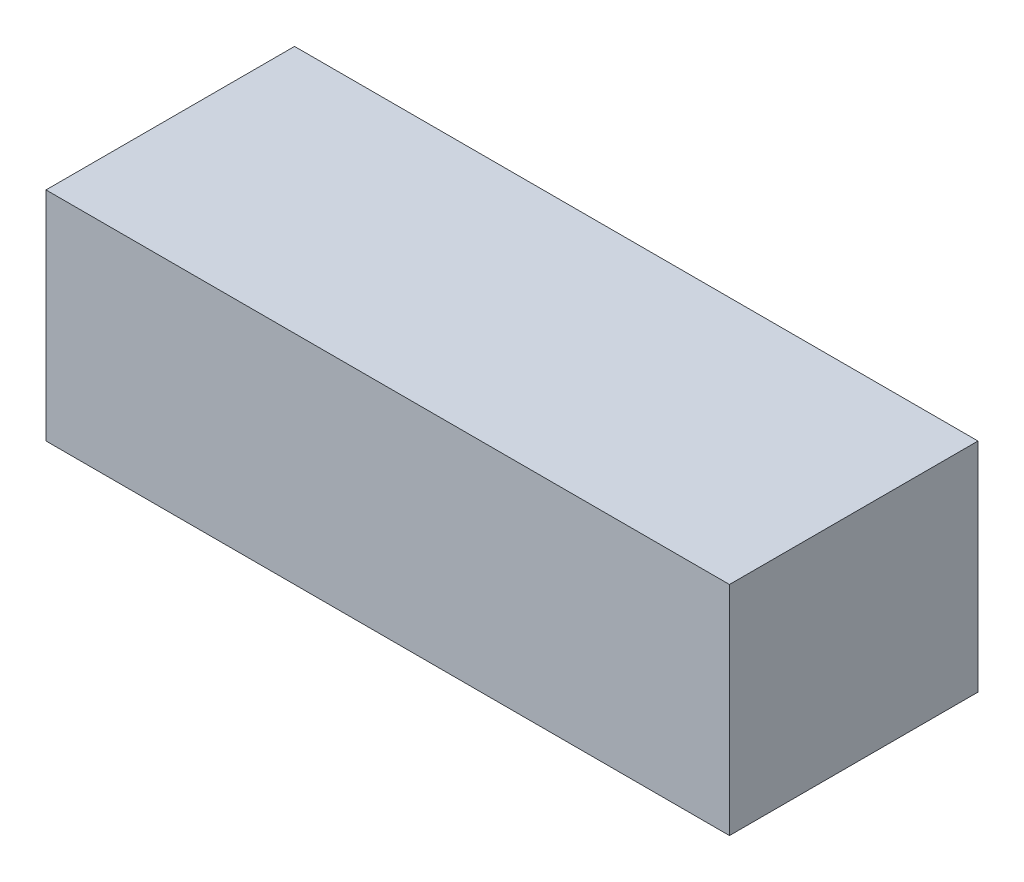
ISO-10303-21;
HEADER;
FILE_DESCRIPTION(('STEP AP214'),'2;1');
FILE_NAME('part.step','',(''),(''),'','','');
FILE_SCHEMA(('AUTOMOTIVE_DESIGN { 1 0 10303 214 1 1 1 1 }'));
ENDSEC;
DATA;
#1=APPLICATION_CONTEXT('core data for automotive mechanical design processes');
#2=APPLICATION_PROTOCOL_DEFINITION('international standard','automotive_design',2000,#1);
#3=PRODUCT_CONTEXT('',#1,'mechanical');
#4=PRODUCT('Part','Part','',(#3));
#5=PRODUCT_RELATED_PRODUCT_CATEGORY('part','',(#4));
#6=PRODUCT_DEFINITION_FORMATION('','',#4);
#7=PRODUCT_DEFINITION_CONTEXT('part definition',#1,'design');
#8=PRODUCT_DEFINITION('design','',#6,#7);
#9=PRODUCT_DEFINITION_SHAPE('','',#8);
#10=(LENGTH_UNIT() NAMED_UNIT(*) SI_UNIT(.MILLI.,.METRE.));
#11=(NAMED_UNIT(*) PLANE_ANGLE_UNIT() SI_UNIT($,.RADIAN.));
#12=(NAMED_UNIT(*) SI_UNIT($,.STERADIAN.) SOLID_ANGLE_UNIT());
#13=UNCERTAINTY_MEASURE_WITH_UNIT(LENGTH_MEASURE(1.E-05),#10,'distance_accuracy_value','');
#14=(GEOMETRIC_REPRESENTATION_CONTEXT(3) GLOBAL_UNCERTAINTY_ASSIGNED_CONTEXT((#13)) GLOBAL_UNIT_ASSIGNED_CONTEXT((#10,
#11,#12)) REPRESENTATION_CONTEXT('',''));
#15=CARTESIAN_POINT('',(0.,0.,0.));
#16=DIRECTION('',(0.,0.,1.));
#17=DIRECTION('',(1.,0.,0.));
#18=AXIS2_PLACEMENT_3D('',#15,#16,#17);
#19=CARTESIAN_POINT('',(22.,14.,8.));
#20=DIRECTION('',(-1.,0.,0.));
#21=DIRECTION('',(0.,0.,1.));
#22=AXIS2_PLACEMENT_3D('',#19,#20,#21);
#23=PLANE('',#22);
#24=DIRECTION('',(0.,0.,-1.));
#25=VECTOR('',#24,1.);
#26=CARTESIAN_POINT('',(22.,0.,8.));
#27=LINE('',#26,#25);
#28=CARTESIAN_POINT('',(22.,0.,8.));
#29=VERTEX_POINT('',#28);
#30=CARTESIAN_POINT('',(22.,0.,-8.));
#31=VERTEX_POINT('',#30);
#32=EDGE_CURVE('E96',#29,#31,#27,.T.);
#33=ORIENTED_EDGE('',*,*,#32,.T.);
#34=DIRECTION('',(0.,-1.,0.));
#35=VECTOR('',#34,1.);
#36=CARTESIAN_POINT('',(22.,14.,-8.));
#37=LINE('',#36,#35);
#38=CARTESIAN_POINT('',(22.,14.,-8.));
#39=VERTEX_POINT('',#38);
#40=EDGE_CURVE('E11',#39,#31,#37,.T.);
#41=ORIENTED_EDGE('',*,*,#40,.F.);
#42=DIRECTION('',(0.,0.,-1.));
#43=VECTOR('',#42,1.);
#44=CARTESIAN_POINT('',(22.,14.,8.));
#45=LINE('',#44,#43);
#46=CARTESIAN_POINT('',(22.,14.,8.));
#47=VERTEX_POINT('',#46);
#48=EDGE_CURVE('E84',#47,#39,#45,.T.);
#49=ORIENTED_EDGE('',*,*,#48,.F.);
#50=DIRECTION('',(0.,-1.,0.));
#51=VECTOR('',#50,1.);
#52=CARTESIAN_POINT('',(22.,14.,8.));
#53=LINE('',#52,#51);
#54=EDGE_CURVE('E92',#47,#29,#53,.T.);
#55=ORIENTED_EDGE('',*,*,#54,.T.);
#56=EDGE_LOOP('',(#33,#41,#49,#55));
#57=FACE_BOUND('',#56,.T.);
#58=ADVANCED_FACE('F33',(#57),#23,.F.);
#59=CARTESIAN_POINT('',(-22.,14.,-8.));
#60=DIRECTION('',(0.,0.,1.));
#61=DIRECTION('',(1.,0.,0.));
#62=AXIS2_PLACEMENT_3D('',#59,#60,#61);
#63=PLANE('',#62);
#64=DIRECTION('',(-1.,0.,0.));
#65=VECTOR('',#64,1.);
#66=CARTESIAN_POINT('',(-22.,0.,-8.));
#67=LINE('',#66,#65);
#68=CARTESIAN_POINT('',(-22.,0.,-8.));
#69=VERTEX_POINT('',#68);
#70=EDGE_CURVE('E88',#31,#69,#67,.T.);
#71=ORIENTED_EDGE('',*,*,#70,.T.);
#72=DIRECTION('',(0.,-1.,0.));
#73=VECTOR('',#72,1.);
#74=CARTESIAN_POINT('',(-22.,14.,-8.));
#75=LINE('',#74,#73);
#76=CARTESIAN_POINT('',(-22.,14.,-8.));
#77=VERTEX_POINT('',#76);
#78=EDGE_CURVE('E41',#77,#69,#75,.T.);
#79=ORIENTED_EDGE('',*,*,#78,.F.);
#80=DIRECTION('',(-1.,0.,0.));
#81=VECTOR('',#80,1.);
#82=CARTESIAN_POINT('',(-22.,14.,-8.));
#83=LINE('',#82,#81);
#84=EDGE_CURVE('E79',#39,#77,#83,.T.);
#85=ORIENTED_EDGE('',*,*,#84,.F.);
#86=ORIENTED_EDGE('',*,*,#40,.T.);
#87=EDGE_LOOP('',(#71,#79,#85,#86));
#88=FACE_BOUND('',#87,.T.);
#89=ADVANCED_FACE('F87',(#88),#63,.F.);
#90=CARTESIAN_POINT('',(-22.,14.,8.));
#91=DIRECTION('',(1.,0.,0.));
#92=DIRECTION('',(0.,0.,-1.));
#93=AXIS2_PLACEMENT_3D('',#90,#91,#92);
#94=PLANE('',#93);
#95=DIRECTION('',(0.,0.,1.));
#96=VECTOR('',#95,1.);
#97=CARTESIAN_POINT('',(-22.,0.,8.));
#98=LINE('',#97,#96);
#99=CARTESIAN_POINT('',(-22.,0.,8.));
#100=VERTEX_POINT('',#99);
#101=EDGE_CURVE('E66',#69,#100,#98,.T.);
#102=ORIENTED_EDGE('',*,*,#101,.T.);
#103=DIRECTION('',(0.,-1.,0.));
#104=VECTOR('',#103,1.);
#105=CARTESIAN_POINT('',(-22.,14.,8.));
#106=LINE('',#105,#104);
#107=CARTESIAN_POINT('',(-22.,14.,8.));
#108=VERTEX_POINT('',#107);
#109=EDGE_CURVE('E89',#108,#100,#106,.T.);
#110=ORIENTED_EDGE('',*,*,#109,.F.);
#111=DIRECTION('',(0.,0.,1.));
#112=VECTOR('',#111,1.);
#113=CARTESIAN_POINT('',(-22.,14.,8.));
#114=LINE('',#113,#112);
#115=EDGE_CURVE('E82',#77,#108,#114,.T.);
#116=ORIENTED_EDGE('',*,*,#115,.F.);
#117=ORIENTED_EDGE('',*,*,#78,.T.);
#118=EDGE_LOOP('',(#102,#110,#116,#117));
#119=FACE_BOUND('',#118,.T.);
#120=ADVANCED_FACE('F90',(#119),#94,.F.);
#121=CARTESIAN_POINT('',(-22.,14.,8.));
#122=DIRECTION('',(0.,0.,-1.));
#123=DIRECTION('',(-1.,0.,0.));
#124=AXIS2_PLACEMENT_3D('',#121,#122,#123);
#125=PLANE('',#124);
#126=DIRECTION('',(1.,0.,0.));
#127=VECTOR('',#126,1.);
#128=CARTESIAN_POINT('',(-22.,0.,8.));
#129=LINE('',#128,#127);
#130=EDGE_CURVE('E72',#100,#29,#129,.T.);
#131=ORIENTED_EDGE('',*,*,#130,.T.);
#132=ORIENTED_EDGE('',*,*,#54,.F.);
#133=DIRECTION('',(1.,0.,0.));
#134=VECTOR('',#133,1.);
#135=CARTESIAN_POINT('',(-22.,14.,8.));
#136=LINE('',#135,#134);
#137=EDGE_CURVE('E49',#108,#47,#136,.T.);
#138=ORIENTED_EDGE('',*,*,#137,.F.);
#139=ORIENTED_EDGE('',*,*,#109,.T.);
#140=EDGE_LOOP('',(#131,#132,#138,#139));
#141=FACE_BOUND('',#140,.T.);
#142=ADVANCED_FACE('F103',(#141),#125,.F.);
#143=CARTESIAN_POINT('',(0.,14.,0.));
#144=DIRECTION('',(0.,-1.,0.));
#145=DIRECTION('',(0.,0.,-1.));
#146=AXIS2_PLACEMENT_3D('',#143,#144,#145);
#147=PLANE('',#146);
#148=ORIENTED_EDGE('',*,*,#48,.T.);
#149=ORIENTED_EDGE('',*,*,#84,.T.);
#150=ORIENTED_EDGE('',*,*,#115,.T.);
#151=ORIENTED_EDGE('',*,*,#137,.T.);
#152=EDGE_LOOP('',(#148,#149,#150,#151));
#153=FACE_BOUND('',#152,.T.);
#154=ADVANCED_FACE('F80',(#153),#147,.F.);
#155=CARTESIAN_POINT('',(0.,0.,0.));
#156=DIRECTION('',(0.,-1.,0.));
#157=DIRECTION('',(0.,0.,-1.));
#158=AXIS2_PLACEMENT_3D('',#155,#156,#157);
#159=PLANE('',#158);
#160=ORIENTED_EDGE('',*,*,#32,.F.);
#161=ORIENTED_EDGE('',*,*,#130,.F.);
#162=ORIENTED_EDGE('',*,*,#101,.F.);
#163=ORIENTED_EDGE('',*,*,#70,.F.);
#164=EDGE_LOOP('',(#160,#161,#162,#163));
#165=FACE_BOUND('',#164,.T.);
#166=ADVANCED_FACE('F106',(#165),#159,.T.);
#167=CLOSED_SHELL('',(#58,#89,#120,#142,#154,#166));
#168=MANIFOLD_SOLID_BREP('B2',#167);
#169=ADVANCED_BREP_SHAPE_REPRESENTATION('',(#18,#168),#14);
#170=SHAPE_DEFINITION_REPRESENTATION(#9,#169);
ENDSEC;
END-ISO-10303-21;
